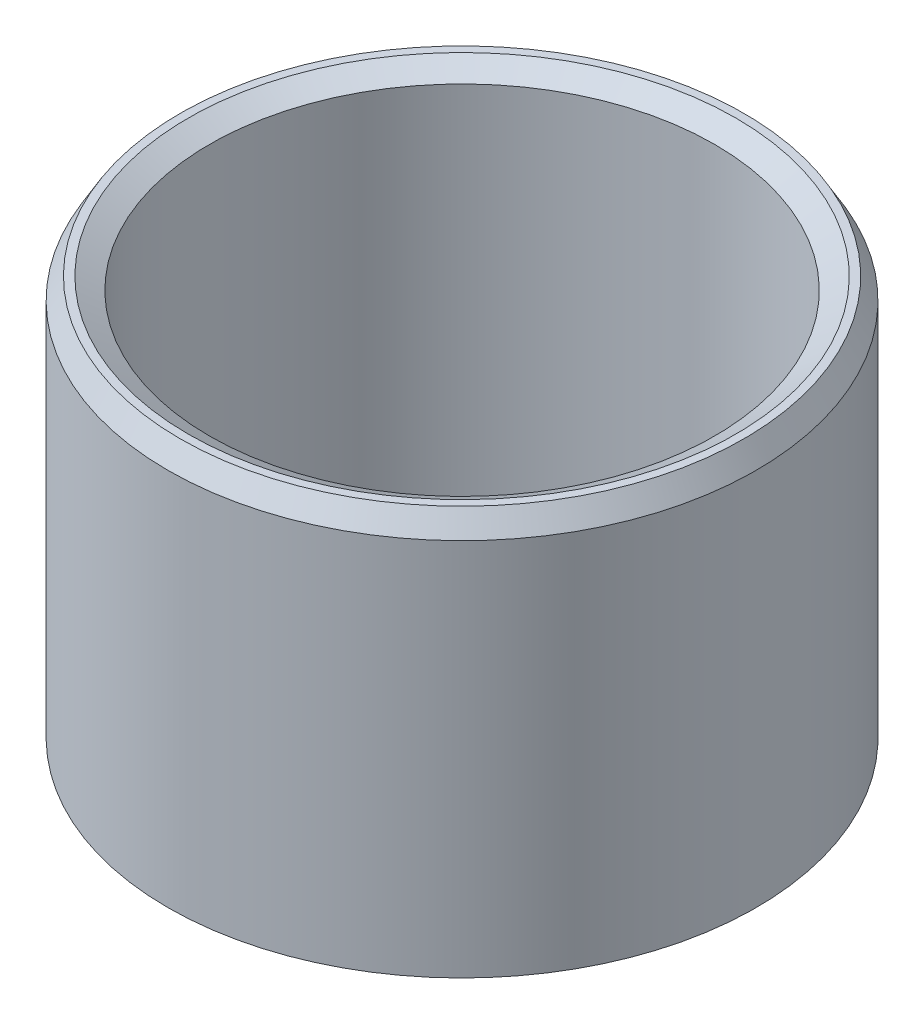
ISO-10303-21;
HEADER;
FILE_DESCRIPTION(('STEP AP214'),'2;1');
FILE_NAME('part.step','',(''),(''),'','','');
FILE_SCHEMA(('AUTOMOTIVE_DESIGN { 1 0 10303 214 1 1 1 1 }'));
ENDSEC;
DATA;
#1=APPLICATION_CONTEXT('core data for automotive mechanical design processes');
#2=APPLICATION_PROTOCOL_DEFINITION('international standard','automotive_design',2000,#1);
#3=PRODUCT_CONTEXT('',#1,'mechanical');
#4=PRODUCT('Part','Part','',(#3));
#5=PRODUCT_RELATED_PRODUCT_CATEGORY('part','',(#4));
#6=PRODUCT_DEFINITION_FORMATION('','',#4);
#7=PRODUCT_DEFINITION_CONTEXT('part definition',#1,'design');
#8=PRODUCT_DEFINITION('design','',#6,#7);
#9=PRODUCT_DEFINITION_SHAPE('','',#8);
#10=(LENGTH_UNIT() NAMED_UNIT(*) SI_UNIT(.MILLI.,.METRE.));
#11=(NAMED_UNIT(*) PLANE_ANGLE_UNIT() SI_UNIT($,.RADIAN.));
#12=(NAMED_UNIT(*) SI_UNIT($,.STERADIAN.) SOLID_ANGLE_UNIT());
#13=UNCERTAINTY_MEASURE_WITH_UNIT(LENGTH_MEASURE(1.E-05),#10,'distance_accuracy_value','');
#14=(GEOMETRIC_REPRESENTATION_CONTEXT(3) GLOBAL_UNCERTAINTY_ASSIGNED_CONTEXT((#13)) GLOBAL_UNIT_ASSIGNED_CONTEXT((#10,
#11,#12)) REPRESENTATION_CONTEXT('',''));
#15=CARTESIAN_POINT('',(0.,0.,0.));
#16=DIRECTION('',(0.,0.,1.));
#17=DIRECTION('',(1.,0.,0.));
#18=AXIS2_PLACEMENT_3D('',#15,#16,#17);
#19=CARTESIAN_POINT('',(0.,49.0441414024533,0.));
#20=DIRECTION('',(0.,-1.,0.));
#21=DIRECTION('',(0.,0.,-1.));
#22=AXIS2_PLACEMENT_3D('',#19,#20,#21);
#23=CYLINDRICAL_SURFACE('',#22,35.);
#24=CARTESIAN_POINT('',(0.,1.45582679910207,0.));
#25=DIRECTION('',(0.,1.,0.));
#26=DIRECTION('',(0.,0.,1.));
#27=AXIS2_PLACEMENT_3D('',#24,#25,#26);
#28=CIRCLE('',#27,35.);
#29=CARTESIAN_POINT('',(0.,1.45582679910207,35.));
#30=VERTEX_POINT('',#29);
#31=EDGE_CURVE('E10',#30,#30,#28,.T.);
#32=ORIENTED_EDGE('',*,*,#31,.T.);
#33=EDGE_LOOP('',(#32));
#34=FACE_BOUND('',#33,.T.);
#35=CARTESIAN_POINT('',(0.,46.5225754193882,0.));
#36=DIRECTION('',(0.,1.,0.));
#37=DIRECTION('',(0.,0.,1.));
#38=AXIS2_PLACEMENT_3D('',#35,#36,#37);
#39=CIRCLE('',#38,35.);
#40=CARTESIAN_POINT('',(0.,46.5225754193882,35.));
#41=VERTEX_POINT('',#40);
#42=EDGE_CURVE('E50',#41,#41,#39,.F.);
#43=ORIENTED_EDGE('',*,*,#42,.T.);
#44=EDGE_LOOP('',(#43));
#45=FACE_BOUND('',#44,.T.);
#46=ADVANCED_FACE('F39',(#34,#45),#23,.T.);
#47=CARTESIAN_POINT('',(0.,49.0441414024533,0.));
#48=DIRECTION('',(0.,1.,0.));
#49=DIRECTION('',(0.,0.,1.));
#50=AXIS2_PLACEMENT_3D('',#47,#48,#49);
#51=PLANE('',#50);
#52=CARTESIAN_POINT('',(0.,49.0441414024533,0.));
#53=DIRECTION('',(0.,1.,0.));
#54=DIRECTION('',(0.,0.,1.));
#55=AXIS2_PLACEMENT_3D('',#52,#53,#54);
#56=CIRCLE('',#55,32.5811080859028);
#57=CARTESIAN_POINT('',(0.,49.0441414024533,32.5811080859028));
#58=VERTEX_POINT('',#57);
#59=EDGE_CURVE('E58',#58,#58,#56,.F.);
#60=ORIENTED_EDGE('',*,*,#59,.T.);
#61=EDGE_LOOP('',(#60));
#62=FACE_BOUND('',#61,.T.);
#63=CARTESIAN_POINT('',(0.,49.0441414024533,0.));
#64=DIRECTION('',(0.,1.,0.));
#65=DIRECTION('',(0.,0.,1.));
#66=AXIS2_PLACEMENT_3D('',#63,#64,#65);
#67=CIRCLE('',#66,33.544173200898);
#68=CARTESIAN_POINT('',(0.,49.0441414024533,33.544173200898));
#69=VERTEX_POINT('',#68);
#70=EDGE_CURVE('E61',#69,#69,#67,.T.);
#71=ORIENTED_EDGE('',*,*,#70,.T.);
#72=EDGE_LOOP('',(#71));
#73=FACE_BOUND('',#72,.T.);
#74=ADVANCED_FACE('F88',(#62,#73),#51,.T.);
#75=CARTESIAN_POINT('',(0.,0.,0.));
#76=DIRECTION('',(0.,1.,0.));
#77=DIRECTION('',(0.,0.,1.));
#78=AXIS2_PLACEMENT_3D('',#75,#76,#77);
#79=PLANE('',#78);
#80=CARTESIAN_POINT('',(0.,0.,0.));
#81=DIRECTION('',(0.,1.,0.));
#82=DIRECTION('',(0.,0.,1.));
#83=AXIS2_PLACEMENT_3D('',#80,#81,#82);
#84=CIRCLE('',#83,31.5153689019396);
#85=CARTESIAN_POINT('',(0.,0.,31.5153689019396));
#86=VERTEX_POINT('',#85);
#87=EDGE_CURVE('E51',#86,#86,#84,.T.);
#88=ORIENTED_EDGE('',*,*,#87,.T.);
#89=EDGE_LOOP('',(#88));
#90=FACE_BOUND('',#89,.T.);
#91=CARTESIAN_POINT('',(0.,0.,0.));
#92=DIRECTION('',(0.,1.,0.));
#93=DIRECTION('',(0.,0.,1.));
#94=AXIS2_PLACEMENT_3D('',#91,#92,#93);
#95=CIRCLE('',#94,32.4784340169348);
#96=CARTESIAN_POINT('',(0.,0.,32.4784340169348));
#97=VERTEX_POINT('',#96);
#98=EDGE_CURVE('E54',#97,#97,#95,.F.);
#99=ORIENTED_EDGE('',*,*,#98,.T.);
#100=EDGE_LOOP('',(#99));
#101=FACE_BOUND('',#100,.T.);
#102=ADVANCED_FACE('F83',(#90,#101),#79,.F.);
#103=CARTESIAN_POINT('',(0.,49.0441414024533,0.));
#104=DIRECTION('',(0.,-1.,0.));
#105=DIRECTION('',(0.,0.,-1.));
#106=AXIS2_PLACEMENT_3D('',#103,#104,#105);
#107=CYLINDRICAL_SURFACE('',#106,30.0595421028376);
#108=CARTESIAN_POINT('',(0.,47.5883146033513,0.));
#109=DIRECTION('',(0.,1.,0.));
#110=DIRECTION('',(0.,0.,1.));
#111=AXIS2_PLACEMENT_3D('',#108,#109,#110);
#112=CIRCLE('',#111,30.0595421028376);
#113=CARTESIAN_POINT('',(0.,47.5883146033513,30.0595421028376));
#114=VERTEX_POINT('',#113);
#115=EDGE_CURVE('E67',#114,#114,#112,.T.);
#116=ORIENTED_EDGE('',*,*,#115,.T.);
#117=EDGE_LOOP('',(#116));
#118=FACE_BOUND('',#117,.T.);
#119=CARTESIAN_POINT('',(0.,2.52156598306517,0.));
#120=DIRECTION('',(0.,1.,0.));
#121=DIRECTION('',(0.,0.,1.));
#122=AXIS2_PLACEMENT_3D('',#119,#120,#121);
#123=CIRCLE('',#122,30.0595421028376);
#124=CARTESIAN_POINT('',(0.,2.52156598306517,30.0595421028376));
#125=VERTEX_POINT('',#124);
#126=EDGE_CURVE('E69',#125,#125,#123,.F.);
#127=ORIENTED_EDGE('',*,*,#126,.T.);
#128=EDGE_LOOP('',(#127));
#129=FACE_BOUND('',#128,.T.);
#130=ADVANCED_FACE('F71',(#118,#129),#107,.F.);
#131=CARTESIAN_POINT('',(0.,47.5883146033513,0.));
#132=DIRECTION('',(0.,1.,0.));
#133=DIRECTION('',(0.,0.,1.));
#134=AXIS2_PLACEMENT_3D('',#131,#132,#133);
#135=CONICAL_SURFACE('',#134,30.0595421028376,1.0471975511966);
#136=ORIENTED_EDGE('',*,*,#59,.F.);
#137=EDGE_LOOP('',(#136));
#138=FACE_BOUND('',#137,.T.);
#139=ORIENTED_EDGE('',*,*,#115,.F.);
#140=EDGE_LOOP('',(#139));
#141=FACE_BOUND('',#140,.T.);
#142=ADVANCED_FACE('F77',(#138,#141),#135,.F.);
#143=CARTESIAN_POINT('',(0.,0.,0.));
#144=DIRECTION('',(0.,-1.,0.));
#145=DIRECTION('',(0.,0.,-1.));
#146=AXIS2_PLACEMENT_3D('',#143,#144,#145);
#147=CONICAL_SURFACE('',#146,31.5153689019396,0.523598775598294);
#148=ORIENTED_EDGE('',*,*,#126,.F.);
#149=EDGE_LOOP('',(#148));
#150=FACE_BOUND('',#149,.T.);
#151=ORIENTED_EDGE('',*,*,#87,.F.);
#152=EDGE_LOOP('',(#151));
#153=FACE_BOUND('',#152,.T.);
#154=ADVANCED_FACE('F73',(#150,#153),#147,.F.);
#155=CARTESIAN_POINT('',(0.,1.45582679910207,0.));
#156=DIRECTION('',(0.,1.,0.));
#157=DIRECTION('',(0.,0.,1.));
#158=AXIS2_PLACEMENT_3D('',#155,#156,#157);
#159=CONICAL_SURFACE('',#158,35.,1.0471975511966);
#160=ORIENTED_EDGE('',*,*,#98,.F.);
#161=EDGE_LOOP('',(#160));
#162=FACE_BOUND('',#161,.T.);
#163=ORIENTED_EDGE('',*,*,#31,.F.);
#164=EDGE_LOOP('',(#163));
#165=FACE_BOUND('',#164,.T.);
#166=ADVANCED_FACE('F76',(#162,#165),#159,.T.);
#167=CARTESIAN_POINT('',(0.,49.0441414024533,0.));
#168=DIRECTION('',(0.,-1.,0.));
#169=DIRECTION('',(0.,0.,-1.));
#170=AXIS2_PLACEMENT_3D('',#167,#168,#169);
#171=CONICAL_SURFACE('',#170,33.544173200898,0.523598775598297);
#172=ORIENTED_EDGE('',*,*,#42,.F.);
#173=EDGE_LOOP('',(#172));
#174=FACE_BOUND('',#173,.T.);
#175=ORIENTED_EDGE('',*,*,#70,.F.);
#176=EDGE_LOOP('',(#175));
#177=FACE_BOUND('',#176,.T.);
#178=ADVANCED_FACE('F45',(#174,#177),#171,.T.);
#179=CLOSED_SHELL('',(#46,#74,#102,#130,#142,#154,#166,#178));
#180=MANIFOLD_SOLID_BREP('B2',#179);
#181=ADVANCED_BREP_SHAPE_REPRESENTATION('',(#18,#180),#14);
#182=SHAPE_DEFINITION_REPRESENTATION(#9,#181);
ENDSEC;
END-ISO-10303-21;
